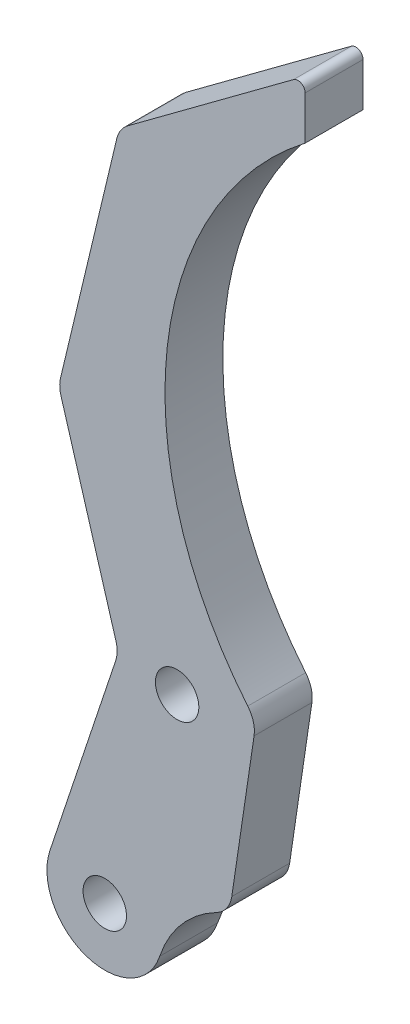
ISO-10303-21;
HEADER;
FILE_DESCRIPTION(('STEP AP214'),'2;1');
FILE_NAME('part.step','',(''),(''),'','','');
FILE_SCHEMA(('AUTOMOTIVE_DESIGN { 1 0 10303 214 1 1 1 1 }'));
ENDSEC;
DATA;
#1=APPLICATION_CONTEXT('core data for automotive mechanical design processes');
#2=APPLICATION_PROTOCOL_DEFINITION('international standard','automotive_design',2000,#1);
#3=PRODUCT_CONTEXT('',#1,'mechanical');
#4=PRODUCT('Part','Part','',(#3));
#5=PRODUCT_RELATED_PRODUCT_CATEGORY('part','',(#4));
#6=PRODUCT_DEFINITION_FORMATION('','',#4);
#7=PRODUCT_DEFINITION_CONTEXT('part definition',#1,'design');
#8=PRODUCT_DEFINITION('design','',#6,#7);
#9=PRODUCT_DEFINITION_SHAPE('','',#8);
#10=(LENGTH_UNIT() NAMED_UNIT(*) SI_UNIT(.MILLI.,.METRE.));
#11=(NAMED_UNIT(*) PLANE_ANGLE_UNIT() SI_UNIT($,.RADIAN.));
#12=(NAMED_UNIT(*) SI_UNIT($,.STERADIAN.) SOLID_ANGLE_UNIT());
#13=UNCERTAINTY_MEASURE_WITH_UNIT(LENGTH_MEASURE(1.E-05),#10,'distance_accuracy_value','');
#14=(GEOMETRIC_REPRESENTATION_CONTEXT(3) GLOBAL_UNCERTAINTY_ASSIGNED_CONTEXT((#13)) GLOBAL_UNIT_ASSIGNED_CONTEXT((#10,
#11,#12)) REPRESENTATION_CONTEXT('',''));
#15=CARTESIAN_POINT('',(0.,0.,0.));
#16=DIRECTION('',(0.,0.,1.));
#17=DIRECTION('',(1.,0.,0.));
#18=AXIS2_PLACEMENT_3D('',#15,#16,#17);
#19=CARTESIAN_POINT('',(9.9580579753652,55.9149215044284,4.));
#20=DIRECTION('',(0.,0.,-1.));
#21=DIRECTION('',(-1.,0.,0.));
#22=AXIS2_PLACEMENT_3D('',#19,#20,#21);
#23=PLANE('',#22);
#24=CARTESIAN_POINT('',(9.9580579753652,55.9149215044284,4.));
#25=DIRECTION('',(0.,0.,-1.));
#26=DIRECTION('',(-1.,0.,0.));
#27=AXIS2_PLACEMENT_3D('',#24,#25,#26);
#28=CIRCLE('',#27,25.);
#29=CARTESIAN_POINT('',(-9.31952103003914,39.997165767818,4.));
#30=VERTEX_POINT('',#29);
#31=CARTESIAN_POINT('',(-5.35274662100727,75.677999772039,4.));
#32=VERTEX_POINT('',#31);
#33=EDGE_CURVE('E207',#30,#32,#28,.T.);
#34=ORIENTED_EDGE('',*,*,#33,.T.);
#35=DIRECTION('',(0.,1.,0.));
#36=VECTOR('',#35,1.);
#37=CARTESIAN_POINT('',(-5.35274662100727,78.6846154430558,4.));
#38=LINE('',#37,#36);
#39=CARTESIAN_POINT('',(-5.35274662100727,78.6846154430558,4.));
#40=VERTEX_POINT('',#39);
#41=EDGE_CURVE('E120',#32,#40,#38,.T.);
#42=ORIENTED_EDGE('',*,*,#41,.T.);
#43=CARTESIAN_POINT('',(-5.85274662100727,78.6846154430558,4.));
#44=DIRECTION('',(0.,0.,1.));
#45=DIRECTION('',(-1.,0.,0.));
#46=AXIS2_PLACEMENT_3D('',#43,#44,#45);
#47=CIRCLE('',#46,0.499999999999991);
#48=CARTESIAN_POINT('',(-6.15061411090899,79.0862059788751,4.));
#49=VERTEX_POINT('',#48);
#50=EDGE_CURVE('E243',#40,#49,#47,.T.);
#51=ORIENTED_EDGE('',*,*,#50,.T.);
#52=DIRECTION('',(-0.803181071638629,-0.595734979803455,0.));
#53=VECTOR('',#52,1.);
#54=CARTESIAN_POINT('',(-17.6189757616203,70.5798996955029,4.));
#55=LINE('',#54,#53);
#56=CARTESIAN_POINT('',(-17.6189757616203,70.5798996955029,4.));
#57=VERTEX_POINT('',#56);
#58=EDGE_CURVE('E262',#49,#57,#55,.T.);
#59=ORIENTED_EDGE('',*,*,#58,.T.);
#60=CARTESIAN_POINT('',(-16.4275058020134,68.9735375522257,4.));
#61=DIRECTION('',(0.,0.,1.));
#62=DIRECTION('',(-1.,0.,0.));
#63=AXIS2_PLACEMENT_3D('',#60,#61,#62);
#64=CIRCLE('',#63,2.);
#65=CARTESIAN_POINT('',(-18.3727744260816,69.4382202183709,4.));
#66=VERTEX_POINT('',#65);
#67=EDGE_CURVE('E259',#57,#66,#64,.T.);
#68=ORIENTED_EDGE('',*,*,#67,.T.);
#69=DIRECTION('',(-0.232341333072594,-0.972634312034102,0.));
#70=VECTOR('',#69,1.);
#71=CARTESIAN_POINT('',(-22.2612764174017,53.1600556354505,4.));
#72=LINE('',#71,#70);
#73=CARTESIAN_POINT('',(-22.2612764174017,53.1600556354505,4.));
#74=VERTEX_POINT('',#73);
#75=EDGE_CURVE('E261',#66,#74,#72,.T.);
#76=ORIENTED_EDGE('',*,*,#75,.T.);
#77=CARTESIAN_POINT('',(-20.3160077933335,52.6953729693053,4.));
#78=DIRECTION('',(0.,0.,1.));
#79=DIRECTION('',(-1.,0.,0.));
#80=AXIS2_PLACEMENT_3D('',#77,#78,#79);
#81=CIRCLE('',#80,2.);
#82=CARTESIAN_POINT('',(-22.2330011720339,52.1251656508512,4.));
#83=VERTEX_POINT('',#82);
#84=EDGE_CURVE('E264',#74,#83,#81,.T.);
#85=ORIENTED_EDGE('',*,*,#84,.T.);
#86=DIRECTION('',(0.285103659227046,-0.958496689350228,0.));
#87=VECTOR('',#86,1.);
#88=CARTESIAN_POINT('',(-18.4315703806583,39.3450461735848,4.));
#89=LINE('',#88,#87);
#90=CARTESIAN_POINT('',(-18.4315703806583,39.3450461735848,4.));
#91=VERTEX_POINT('',#90);
#92=EDGE_CURVE('E270',#83,#91,#89,.T.);
#93=ORIENTED_EDGE('',*,*,#92,.T.);
#94=CARTESIAN_POINT('',(-20.3485637593588,38.7748388551307,4.));
#95=DIRECTION('',(0.,0.,-1.));
#96=DIRECTION('',(1.,0.,0.));
#97=AXIS2_PLACEMENT_3D('',#94,#95,#96);
#98=CIRCLE('',#97,2.);
#99=CARTESIAN_POINT('',(-18.4511972326077,38.1423831150474,4.));
#100=VERTEX_POINT('',#99);
#101=EDGE_CURVE('E272',#91,#100,#98,.T.);
#102=ORIENTED_EDGE('',*,*,#101,.T.);
#103=DIRECTION('',(-0.316227870041676,-0.948683263375562,0.));
#104=VECTOR('',#103,1.);
#105=CARTESIAN_POINT('',(-22.995202754365,24.5103715323581,4.));
#106=LINE('',#105,#104);
#107=CARTESIAN_POINT('',(-22.995202754365,24.5103715323581,4.));
#108=VERTEX_POINT('',#107);
#109=EDGE_CURVE('E274',#100,#108,#106,.T.);
#110=ORIENTED_EDGE('',*,*,#109,.T.);
#111=CARTESIAN_POINT('',(-19.2004680560857,23.2454595039322,4.));
#112=DIRECTION('',(0.,0.,1.));
#113=DIRECTION('',(1.,0.,0.));
#114=AXIS2_PLACEMENT_3D('',#111,#112,#113);
#115=CIRCLE('',#114,4.00000173374733);
#116=CARTESIAN_POINT('',(-15.4057333578063,21.9805474755062,4.));
#117=VERTEX_POINT('',#116);
#118=EDGE_CURVE('E276',#108,#117,#115,.T.);
#119=ORIENTED_EDGE('',*,*,#118,.T.);
#120=CARTESIAN_POINT('',(-7.81626725080184,19.4507245151728,4.));
#121=DIRECTION('',(0.,0.,-1.));
#122=DIRECTION('',(-1.,0.,0.));
#123=AXIS2_PLACEMENT_3D('',#120,#121,#122);
#124=CIRCLE('',#123,8.);
#125=CARTESIAN_POINT('',(-11.4848022519829,26.5600037293485,4.));
#126=VERTEX_POINT('',#125);
#127=EDGE_CURVE('E160',#117,#126,#124,.T.);
#128=ORIENTED_EDGE('',*,*,#127,.T.);
#129=CARTESIAN_POINT('',(-12.4019360022781,28.3373235328924,4.));
#130=DIRECTION('',(0.,0.,1.));
#131=DIRECTION('',(1.,0.,0.));
#132=AXIS2_PLACEMENT_3D('',#129,#130,#131);
#133=CIRCLE('',#132,2.);
#134=CARTESIAN_POINT('',(-10.4235699497073,28.0439504563578,4.));
#135=VERTEX_POINT('',#134);
#136=EDGE_CURVE('E154',#126,#135,#133,.T.);
#137=ORIENTED_EDGE('',*,*,#136,.T.);
#138=DIRECTION('',(0.146686538267296,0.989183026285407,0.));
#139=VECTOR('',#138,1.);
#140=CARTESIAN_POINT('',(-8.88336129790067,38.4303722323546,4.));
#141=LINE('',#140,#139);
#142=CARTESIAN_POINT('',(-8.88336129790067,38.4303722323546,4.));
#143=VERTEX_POINT('',#142);
#144=EDGE_CURVE('E158',#135,#143,#141,.T.);
#145=ORIENTED_EDGE('',*,*,#144,.T.);
#146=CARTESIAN_POINT('',(-10.8617273504715,38.7237453088892,4.));
#147=DIRECTION('',(0.,0.,1.));
#148=DIRECTION('',(1.,0.,0.));
#149=AXIS2_PLACEMENT_3D('',#146,#147,#148);
#150=CIRCLE('',#149,2.);
#151=EDGE_CURVE('E56',#143,#30,#150,.T.);
#152=ORIENTED_EDGE('',*,*,#151,.T.);
#153=EDGE_LOOP('',(#34,#42,#51,#59,#68,#76,#85,#93,#102,#110,#119,#128,#137,#145,#152));
#154=FACE_BOUND('',#153,.T.);
#155=CARTESIAN_POINT('',(-19.2004680560857,23.2454595039322,4.));
#156=DIRECTION('',(0.,0.,1.));
#157=DIRECTION('',(-1.,0.,0.));
#158=AXIS2_PLACEMENT_3D('',#155,#156,#157);
#159=CIRCLE('',#158,1.5);
#160=CARTESIAN_POINT('',(-20.7004680560857,23.2454595039322,4.));
#161=VERTEX_POINT('',#160);
#162=EDGE_CURVE('E182',#161,#161,#159,.T.);
#163=ORIENTED_EDGE('',*,*,#162,.F.);
#164=EDGE_LOOP('',(#163));
#165=FACE_BOUND('',#164,.T.);
#166=CARTESIAN_POINT('',(-14.2004680560857,38.2454595039322,4.));
#167=DIRECTION('',(0.,0.,1.));
#168=DIRECTION('',(1.,0.,0.));
#169=AXIS2_PLACEMENT_3D('',#166,#167,#168);
#170=CIRCLE('',#169,1.5);
#171=CARTESIAN_POINT('',(-12.7004680560857,38.2454595039322,4.));
#172=VERTEX_POINT('',#171);
#173=EDGE_CURVE('E317',#172,#172,#170,.T.);
#174=ORIENTED_EDGE('',*,*,#173,.F.);
#175=EDGE_LOOP('',(#174));
#176=FACE_BOUND('',#175,.T.);
#177=ADVANCED_FACE('F39',(#154,#165,#176),#23,.F.);
#178=CARTESIAN_POINT('',(9.9580579753652,55.9149215044284,0.));
#179=DIRECTION('',(0.,0.,-1.));
#180=DIRECTION('',(-1.,0.,0.));
#181=AXIS2_PLACEMENT_3D('',#178,#179,#180);
#182=PLANE('',#181);
#183=CARTESIAN_POINT('',(-19.2004680560857,23.2454595039322,0.));
#184=DIRECTION('',(0.,0.,1.));
#185=DIRECTION('',(-1.,0.,0.));
#186=AXIS2_PLACEMENT_3D('',#183,#184,#185);
#187=CIRCLE('',#186,1.5);
#188=CARTESIAN_POINT('',(-20.7004680560857,23.2454595039322,0.));
#189=VERTEX_POINT('',#188);
#190=EDGE_CURVE('E322',#189,#189,#187,.T.);
#191=ORIENTED_EDGE('',*,*,#190,.T.);
#192=EDGE_LOOP('',(#191));
#193=FACE_BOUND('',#192,.T.);
#194=CARTESIAN_POINT('',(9.9580579753652,55.9149215044284,0.));
#195=DIRECTION('',(0.,0.,-1.));
#196=DIRECTION('',(-1.,0.,0.));
#197=AXIS2_PLACEMENT_3D('',#194,#195,#196);
#198=CIRCLE('',#197,25.);
#199=CARTESIAN_POINT('',(-9.31952103003914,39.997165767818,0.));
#200=VERTEX_POINT('',#199);
#201=CARTESIAN_POINT('',(-5.35274662100727,75.677999772039,0.));
#202=VERTEX_POINT('',#201);
#203=EDGE_CURVE('E178',#200,#202,#198,.T.);
#204=ORIENTED_EDGE('',*,*,#203,.F.);
#205=CARTESIAN_POINT('',(-10.8617273504715,38.7237453088892,0.));
#206=DIRECTION('',(0.,0.,1.));
#207=DIRECTION('',(1.,0.,0.));
#208=AXIS2_PLACEMENT_3D('',#205,#206,#207);
#209=CIRCLE('',#208,2.);
#210=CARTESIAN_POINT('',(-8.88336129790067,38.4303722323546,0.));
#211=VERTEX_POINT('',#210);
#212=EDGE_CURVE('E112',#211,#200,#209,.T.);
#213=ORIENTED_EDGE('',*,*,#212,.F.);
#214=DIRECTION('',(0.146686538267296,0.989183026285407,0.));
#215=VECTOR('',#214,1.);
#216=CARTESIAN_POINT('',(-8.88336129790067,38.4303722323546,0.));
#217=LINE('',#216,#215);
#218=CARTESIAN_POINT('',(-10.4235699497073,28.0439504563578,0.));
#219=VERTEX_POINT('',#218);
#220=EDGE_CURVE('E106',#219,#211,#217,.T.);
#221=ORIENTED_EDGE('',*,*,#220,.F.);
#222=CARTESIAN_POINT('',(-12.4019360022781,28.3373235328924,0.));
#223=DIRECTION('',(0.,0.,1.));
#224=DIRECTION('',(1.,0.,0.));
#225=AXIS2_PLACEMENT_3D('',#222,#223,#224);
#226=CIRCLE('',#225,2.);
#227=CARTESIAN_POINT('',(-11.4848022519829,26.5600037293485,0.));
#228=VERTEX_POINT('',#227);
#229=EDGE_CURVE('E168',#228,#219,#226,.T.);
#230=ORIENTED_EDGE('',*,*,#229,.F.);
#231=CARTESIAN_POINT('',(-7.81626725080184,19.4507245151728,0.));
#232=DIRECTION('',(0.,0.,-1.));
#233=DIRECTION('',(-1.,0.,0.));
#234=AXIS2_PLACEMENT_3D('',#231,#232,#233);
#235=CIRCLE('',#234,8.);
#236=CARTESIAN_POINT('',(-15.4057333578063,21.9805474755062,0.));
#237=VERTEX_POINT('',#236);
#238=EDGE_CURVE('E202',#237,#228,#235,.T.);
#239=ORIENTED_EDGE('',*,*,#238,.F.);
#240=CARTESIAN_POINT('',(-19.2004680560857,23.2454595039322,0.));
#241=DIRECTION('',(0.,0.,1.));
#242=DIRECTION('',(1.,0.,0.));
#243=AXIS2_PLACEMENT_3D('',#240,#241,#242);
#244=CIRCLE('',#243,4.00000173374733);
#245=CARTESIAN_POINT('',(-22.995202754365,24.5103715323581,0.));
#246=VERTEX_POINT('',#245);
#247=EDGE_CURVE('E200',#246,#237,#244,.T.);
#248=ORIENTED_EDGE('',*,*,#247,.F.);
#249=DIRECTION('',(-0.316227870041676,-0.948683263375562,0.));
#250=VECTOR('',#249,1.);
#251=CARTESIAN_POINT('',(-22.995202754365,24.5103715323581,0.));
#252=LINE('',#251,#250);
#253=CARTESIAN_POINT('',(-18.4511972326077,38.1423831150474,0.));
#254=VERTEX_POINT('',#253);
#255=EDGE_CURVE('E198',#254,#246,#252,.T.);
#256=ORIENTED_EDGE('',*,*,#255,.F.);
#257=CARTESIAN_POINT('',(-20.3485637593588,38.7748388551307,0.));
#258=DIRECTION('',(0.,0.,-1.));
#259=DIRECTION('',(1.,0.,0.));
#260=AXIS2_PLACEMENT_3D('',#257,#258,#259);
#261=CIRCLE('',#260,2.);
#262=CARTESIAN_POINT('',(-18.4315703806583,39.3450461735848,0.));
#263=VERTEX_POINT('',#262);
#264=EDGE_CURVE('E196',#263,#254,#261,.T.);
#265=ORIENTED_EDGE('',*,*,#264,.F.);
#266=DIRECTION('',(0.285103659227046,-0.958496689350228,0.));
#267=VECTOR('',#266,1.);
#268=CARTESIAN_POINT('',(-18.4315703806583,39.3450461735848,0.));
#269=LINE('',#268,#267);
#270=CARTESIAN_POINT('',(-22.2330011720339,52.1251656508512,0.));
#271=VERTEX_POINT('',#270);
#272=EDGE_CURVE('E194',#271,#263,#269,.T.);
#273=ORIENTED_EDGE('',*,*,#272,.F.);
#274=CARTESIAN_POINT('',(-20.3160077933335,52.6953729693053,0.));
#275=DIRECTION('',(0.,0.,1.));
#276=DIRECTION('',(-1.,0.,0.));
#277=AXIS2_PLACEMENT_3D('',#274,#275,#276);
#278=CIRCLE('',#277,2.);
#279=CARTESIAN_POINT('',(-22.2612764174017,53.1600556354505,0.));
#280=VERTEX_POINT('',#279);
#281=EDGE_CURVE('E192',#280,#271,#278,.T.);
#282=ORIENTED_EDGE('',*,*,#281,.F.);
#283=DIRECTION('',(-0.232341333072594,-0.972634312034102,0.));
#284=VECTOR('',#283,1.);
#285=CARTESIAN_POINT('',(-22.2612764174017,53.1600556354505,0.));
#286=LINE('',#285,#284);
#287=CARTESIAN_POINT('',(-18.3727744260816,69.4382202183709,0.));
#288=VERTEX_POINT('',#287);
#289=EDGE_CURVE('E190',#288,#280,#286,.T.);
#290=ORIENTED_EDGE('',*,*,#289,.F.);
#291=CARTESIAN_POINT('',(-16.4275058020134,68.9735375522257,0.));
#292=DIRECTION('',(0.,0.,1.));
#293=DIRECTION('',(-1.,0.,0.));
#294=AXIS2_PLACEMENT_3D('',#291,#292,#293);
#295=CIRCLE('',#294,2.);
#296=CARTESIAN_POINT('',(-17.6189757616203,70.5798996955029,0.));
#297=VERTEX_POINT('',#296);
#298=EDGE_CURVE('E188',#297,#288,#295,.T.);
#299=ORIENTED_EDGE('',*,*,#298,.F.);
#300=DIRECTION('',(-0.803181071638629,-0.595734979803455,0.));
#301=VECTOR('',#300,1.);
#302=CARTESIAN_POINT('',(-17.6189757616203,70.5798996955029,0.));
#303=LINE('',#302,#301);
#304=CARTESIAN_POINT('',(-6.15061411090899,79.0862059788751,0.));
#305=VERTEX_POINT('',#304);
#306=EDGE_CURVE('E186',#305,#297,#303,.T.);
#307=ORIENTED_EDGE('',*,*,#306,.F.);
#308=CARTESIAN_POINT('',(-5.85274662100727,78.6846154430558,0.));
#309=DIRECTION('',(0.,0.,1.));
#310=DIRECTION('',(-1.,0.,0.));
#311=AXIS2_PLACEMENT_3D('',#308,#309,#310);
#312=CIRCLE('',#311,0.499999999999991);
#313=CARTESIAN_POINT('',(-5.35274662100727,78.6846154430558,0.));
#314=VERTEX_POINT('',#313);
#315=EDGE_CURVE('E184',#314,#305,#312,.T.);
#316=ORIENTED_EDGE('',*,*,#315,.F.);
#317=DIRECTION('',(0.,1.,0.));
#318=VECTOR('',#317,1.);
#319=CARTESIAN_POINT('',(-5.35274662100727,78.6846154430558,0.));
#320=LINE('',#319,#318);
#321=EDGE_CURVE('E181',#202,#314,#320,.T.);
#322=ORIENTED_EDGE('',*,*,#321,.F.);
#323=EDGE_LOOP('',(#204,#213,#221,#230,#239,#248,#256,#265,#273,#282,#290,#299,#307,#316,#322));
#324=FACE_BOUND('',#323,.T.);
#325=CARTESIAN_POINT('',(-14.2004680560857,38.2454595039322,0.));
#326=DIRECTION('',(0.,0.,1.));
#327=DIRECTION('',(1.,0.,0.));
#328=AXIS2_PLACEMENT_3D('',#325,#326,#327);
#329=CIRCLE('',#328,1.5);
#330=CARTESIAN_POINT('',(-12.7004680560857,38.2454595039322,0.));
#331=VERTEX_POINT('',#330);
#332=EDGE_CURVE('E320',#331,#331,#329,.T.);
#333=ORIENTED_EDGE('',*,*,#332,.T.);
#334=EDGE_LOOP('',(#333));
#335=FACE_BOUND('',#334,.T.);
#336=ADVANCED_FACE('F247',(#193,#324,#335),#182,.T.);
#337=CARTESIAN_POINT('',(9.9580579753652,55.9149215044284,4.));
#338=DIRECTION('',(0.,0.,-1.));
#339=DIRECTION('',(-1.,0.,0.));
#340=AXIS2_PLACEMENT_3D('',#337,#338,#339);
#341=CYLINDRICAL_SURFACE('',#340,25.);
#342=ORIENTED_EDGE('',*,*,#203,.T.);
#343=DIRECTION('',(0.,0.,-1.));
#344=VECTOR('',#343,1.);
#345=CARTESIAN_POINT('',(-5.35274662100727,75.677999772039,4.));
#346=LINE('',#345,#344);
#347=EDGE_CURVE('E11',#32,#202,#346,.T.);
#348=ORIENTED_EDGE('',*,*,#347,.F.);
#349=ORIENTED_EDGE('',*,*,#33,.F.);
#350=DIRECTION('',(0.,0.,-1.));
#351=VECTOR('',#350,1.);
#352=CARTESIAN_POINT('',(-9.31952103003914,39.997165767818,4.));
#353=LINE('',#352,#351);
#354=EDGE_CURVE('E174',#30,#200,#353,.T.);
#355=ORIENTED_EDGE('',*,*,#354,.T.);
#356=EDGE_LOOP('',(#342,#348,#349,#355));
#357=FACE_BOUND('',#356,.T.);
#358=ADVANCED_FACE('F41',(#357),#341,.F.);
#359=CARTESIAN_POINT('',(-5.35274662100727,78.6846154430558,4.));
#360=DIRECTION('',(-1.,0.,0.));
#361=DIRECTION('',(0.,0.,1.));
#362=AXIS2_PLACEMENT_3D('',#359,#360,#361);
#363=PLANE('',#362);
#364=ORIENTED_EDGE('',*,*,#321,.T.);
#365=DIRECTION('',(0.,0.,-1.));
#366=VECTOR('',#365,1.);
#367=CARTESIAN_POINT('',(-5.35274662100727,78.6846154430558,4.));
#368=LINE('',#367,#366);
#369=EDGE_CURVE('E48',#40,#314,#368,.T.);
#370=ORIENTED_EDGE('',*,*,#369,.F.);
#371=ORIENTED_EDGE('',*,*,#41,.F.);
#372=ORIENTED_EDGE('',*,*,#347,.T.);
#373=EDGE_LOOP('',(#364,#370,#371,#372));
#374=FACE_BOUND('',#373,.T.);
#375=ADVANCED_FACE('F447',(#374),#363,.F.);
#376=CARTESIAN_POINT('',(-5.85274662100727,78.6846154430558,4.));
#377=DIRECTION('',(0.,0.,-1.));
#378=DIRECTION('',(-1.,0.,0.));
#379=AXIS2_PLACEMENT_3D('',#376,#377,#378);
#380=CYLINDRICAL_SURFACE('',#379,0.499999999999991);
#381=ORIENTED_EDGE('',*,*,#315,.T.);
#382=DIRECTION('',(0.,0.,-1.));
#383=VECTOR('',#382,1.);
#384=CARTESIAN_POINT('',(-6.15061411090899,79.0862059788751,4.));
#385=LINE('',#384,#383);
#386=EDGE_CURVE('E235',#49,#305,#385,.T.);
#387=ORIENTED_EDGE('',*,*,#386,.F.);
#388=ORIENTED_EDGE('',*,*,#50,.F.);
#389=ORIENTED_EDGE('',*,*,#369,.T.);
#390=EDGE_LOOP('',(#381,#387,#388,#389));
#391=FACE_BOUND('',#390,.T.);
#392=ADVANCED_FACE('F241',(#391),#380,.T.);
#393=CARTESIAN_POINT('',(-17.6189757616203,70.5798996955029,4.));
#394=DIRECTION('',(0.595734979803455,-0.803181071638629,0.));
#395=DIRECTION('',(0.803181071638629,0.595734979803455,0.));
#396=AXIS2_PLACEMENT_3D('',#393,#394,#395);
#397=PLANE('',#396);
#398=ORIENTED_EDGE('',*,*,#306,.T.);
#399=DIRECTION('',(0.,0.,-1.));
#400=VECTOR('',#399,1.);
#401=CARTESIAN_POINT('',(-17.6189757616203,70.5798996955029,4.));
#402=LINE('',#401,#400);
#403=EDGE_CURVE('E232',#57,#297,#402,.T.);
#404=ORIENTED_EDGE('',*,*,#403,.F.);
#405=ORIENTED_EDGE('',*,*,#58,.F.);
#406=ORIENTED_EDGE('',*,*,#386,.T.);
#407=EDGE_LOOP('',(#398,#404,#405,#406));
#408=FACE_BOUND('',#407,.T.);
#409=ADVANCED_FACE('F253',(#408),#397,.F.);
#410=CARTESIAN_POINT('',(-16.4275058020134,68.9735375522257,4.));
#411=DIRECTION('',(0.,0.,-1.));
#412=DIRECTION('',(-1.,0.,0.));
#413=AXIS2_PLACEMENT_3D('',#410,#411,#412);
#414=CYLINDRICAL_SURFACE('',#413,2.);
#415=ORIENTED_EDGE('',*,*,#298,.T.);
#416=DIRECTION('',(0.,0.,-1.));
#417=VECTOR('',#416,1.);
#418=CARTESIAN_POINT('',(-18.3727744260816,69.4382202183709,4.));
#419=LINE('',#418,#417);
#420=EDGE_CURVE('E229',#66,#288,#419,.T.);
#421=ORIENTED_EDGE('',*,*,#420,.F.);
#422=ORIENTED_EDGE('',*,*,#67,.F.);
#423=ORIENTED_EDGE('',*,*,#403,.T.);
#424=EDGE_LOOP('',(#415,#421,#422,#423));
#425=FACE_BOUND('',#424,.T.);
#426=ADVANCED_FACE('F257',(#425),#414,.T.);
#427=CARTESIAN_POINT('',(-22.2612764174017,53.1600556354505,4.));
#428=DIRECTION('',(0.972634312034102,-0.232341333072594,0.));
#429=DIRECTION('',(0.232341333072594,0.972634312034102,0.));
#430=AXIS2_PLACEMENT_3D('',#427,#428,#429);
#431=PLANE('',#430);
#432=ORIENTED_EDGE('',*,*,#289,.T.);
#433=DIRECTION('',(0.,0.,-1.));
#434=VECTOR('',#433,1.);
#435=CARTESIAN_POINT('',(-22.2612764174017,53.1600556354505,4.));
#436=LINE('',#435,#434);
#437=EDGE_CURVE('E226',#74,#280,#436,.T.);
#438=ORIENTED_EDGE('',*,*,#437,.F.);
#439=ORIENTED_EDGE('',*,*,#75,.F.);
#440=ORIENTED_EDGE('',*,*,#420,.T.);
#441=EDGE_LOOP('',(#432,#438,#439,#440));
#442=FACE_BOUND('',#441,.T.);
#443=ADVANCED_FACE('F412',(#442),#431,.F.);
#444=CARTESIAN_POINT('',(-20.3160077933335,52.6953729693053,4.));
#445=DIRECTION('',(0.,0.,-1.));
#446=DIRECTION('',(-1.,0.,0.));
#447=AXIS2_PLACEMENT_3D('',#444,#445,#446);
#448=CYLINDRICAL_SURFACE('',#447,2.);
#449=ORIENTED_EDGE('',*,*,#281,.T.);
#450=DIRECTION('',(0.,0.,-1.));
#451=VECTOR('',#450,1.);
#452=CARTESIAN_POINT('',(-22.2330011720339,52.1251656508512,4.));
#453=LINE('',#452,#451);
#454=EDGE_CURVE('E223',#83,#271,#453,.T.);
#455=ORIENTED_EDGE('',*,*,#454,.F.);
#456=ORIENTED_EDGE('',*,*,#84,.F.);
#457=ORIENTED_EDGE('',*,*,#437,.T.);
#458=EDGE_LOOP('',(#449,#455,#456,#457));
#459=FACE_BOUND('',#458,.T.);
#460=ADVANCED_FACE('F402',(#459),#448,.T.);
#461=CARTESIAN_POINT('',(-18.4315703806583,39.3450461735848,4.));
#462=DIRECTION('',(0.958496689350228,0.285103659227046,0.));
#463=DIRECTION('',(-0.285103659227046,0.958496689350228,0.));
#464=AXIS2_PLACEMENT_3D('',#461,#462,#463);
#465=PLANE('',#464);
#466=ORIENTED_EDGE('',*,*,#272,.T.);
#467=DIRECTION('',(0.,0.,-1.));
#468=VECTOR('',#467,1.);
#469=CARTESIAN_POINT('',(-18.4315703806583,39.3450461735848,4.));
#470=LINE('',#469,#468);
#471=EDGE_CURVE('E220',#91,#263,#470,.T.);
#472=ORIENTED_EDGE('',*,*,#471,.F.);
#473=ORIENTED_EDGE('',*,*,#92,.F.);
#474=ORIENTED_EDGE('',*,*,#454,.T.);
#475=EDGE_LOOP('',(#466,#472,#473,#474));
#476=FACE_BOUND('',#475,.T.);
#477=ADVANCED_FACE('F392',(#476),#465,.F.);
#478=CARTESIAN_POINT('',(-20.3485637593588,38.7748388551307,4.));
#479=DIRECTION('',(0.,0.,-1.));
#480=DIRECTION('',(-1.,0.,0.));
#481=AXIS2_PLACEMENT_3D('',#478,#479,#480);
#482=CYLINDRICAL_SURFACE('',#481,2.);
#483=ORIENTED_EDGE('',*,*,#264,.T.);
#484=DIRECTION('',(0.,0.,-1.));
#485=VECTOR('',#484,1.);
#486=CARTESIAN_POINT('',(-18.4511972326077,38.1423831150474,4.));
#487=LINE('',#486,#485);
#488=EDGE_CURVE('E217',#100,#254,#487,.T.);
#489=ORIENTED_EDGE('',*,*,#488,.F.);
#490=ORIENTED_EDGE('',*,*,#101,.F.);
#491=ORIENTED_EDGE('',*,*,#471,.T.);
#492=EDGE_LOOP('',(#483,#489,#490,#491));
#493=FACE_BOUND('',#492,.T.);
#494=ADVANCED_FACE('F382',(#493),#482,.F.);
#495=CARTESIAN_POINT('',(-22.995202754365,24.5103715323581,4.));
#496=DIRECTION('',(0.948683263375562,-0.316227870041676,0.));
#497=DIRECTION('',(0.316227870041676,0.948683263375562,0.));
#498=AXIS2_PLACEMENT_3D('',#495,#496,#497);
#499=PLANE('',#498);
#500=ORIENTED_EDGE('',*,*,#255,.T.);
#501=DIRECTION('',(0.,0.,-1.));
#502=VECTOR('',#501,1.);
#503=CARTESIAN_POINT('',(-22.995202754365,24.5103715323581,4.));
#504=LINE('',#503,#502);
#505=EDGE_CURVE('E214',#108,#246,#504,.T.);
#506=ORIENTED_EDGE('',*,*,#505,.F.);
#507=ORIENTED_EDGE('',*,*,#109,.F.);
#508=ORIENTED_EDGE('',*,*,#488,.T.);
#509=EDGE_LOOP('',(#500,#506,#507,#508));
#510=FACE_BOUND('',#509,.T.);
#511=ADVANCED_FACE('F373',(#510),#499,.F.);
#512=CARTESIAN_POINT('',(-19.2004680560857,23.2454595039322,4.));
#513=DIRECTION('',(0.,0.,-1.));
#514=DIRECTION('',(-1.,0.,0.));
#515=AXIS2_PLACEMENT_3D('',#512,#513,#514);
#516=CYLINDRICAL_SURFACE('',#515,4.00000173374733);
#517=ORIENTED_EDGE('',*,*,#247,.T.);
#518=DIRECTION('',(0.,0.,-1.));
#519=VECTOR('',#518,1.);
#520=CARTESIAN_POINT('',(-15.4057333578063,21.9805474755062,4.));
#521=LINE('',#520,#519);
#522=EDGE_CURVE('E211',#117,#237,#521,.T.);
#523=ORIENTED_EDGE('',*,*,#522,.F.);
#524=ORIENTED_EDGE('',*,*,#118,.F.);
#525=ORIENTED_EDGE('',*,*,#505,.T.);
#526=EDGE_LOOP('',(#517,#523,#524,#525));
#527=FACE_BOUND('',#526,.T.);
#528=ADVANCED_FACE('F282',(#527),#516,.T.);
#529=CARTESIAN_POINT('',(-7.81626725080184,19.4507245151728,4.));
#530=DIRECTION('',(0.,0.,-1.));
#531=DIRECTION('',(-1.,0.,0.));
#532=AXIS2_PLACEMENT_3D('',#529,#530,#531);
#533=CYLINDRICAL_SURFACE('',#532,8.);
#534=ORIENTED_EDGE('',*,*,#238,.T.);
#535=DIRECTION('',(0.,0.,-1.));
#536=VECTOR('',#535,1.);
#537=CARTESIAN_POINT('',(-11.4848022519829,26.5600037293485,4.));
#538=LINE('',#537,#536);
#539=EDGE_CURVE('E169',#126,#228,#538,.T.);
#540=ORIENTED_EDGE('',*,*,#539,.F.);
#541=ORIENTED_EDGE('',*,*,#127,.F.);
#542=ORIENTED_EDGE('',*,*,#522,.T.);
#543=EDGE_LOOP('',(#534,#540,#541,#542));
#544=FACE_BOUND('',#543,.T.);
#545=ADVANCED_FACE('F286',(#544),#533,.F.);
#546=CARTESIAN_POINT('',(-12.4019360022781,28.3373235328924,4.));
#547=DIRECTION('',(0.,0.,-1.));
#548=DIRECTION('',(-1.,0.,0.));
#549=AXIS2_PLACEMENT_3D('',#546,#547,#548);
#550=CYLINDRICAL_SURFACE('',#549,2.);
#551=ORIENTED_EDGE('',*,*,#229,.T.);
#552=DIRECTION('',(0.,0.,-1.));
#553=VECTOR('',#552,1.);
#554=CARTESIAN_POINT('',(-10.4235699497073,28.0439504563578,4.));
#555=LINE('',#554,#553);
#556=EDGE_CURVE('E165',#135,#219,#555,.T.);
#557=ORIENTED_EDGE('',*,*,#556,.F.);
#558=ORIENTED_EDGE('',*,*,#136,.F.);
#559=ORIENTED_EDGE('',*,*,#539,.T.);
#560=EDGE_LOOP('',(#551,#557,#558,#559));
#561=FACE_BOUND('',#560,.T.);
#562=ADVANCED_FACE('F166',(#561),#550,.T.);
#563=CARTESIAN_POINT('',(-8.88336129790067,38.4303722323546,4.));
#564=DIRECTION('',(-0.989183026285407,0.146686538267296,0.));
#565=DIRECTION('',(-0.146686538267296,-0.989183026285407,0.));
#566=AXIS2_PLACEMENT_3D('',#563,#564,#565);
#567=PLANE('',#566);
#568=ORIENTED_EDGE('',*,*,#220,.T.);
#569=DIRECTION('',(0.,0.,-1.));
#570=VECTOR('',#569,1.);
#571=CARTESIAN_POINT('',(-8.88336129790067,38.4303722323546,4.));
#572=LINE('',#571,#570);
#573=EDGE_CURVE('E170',#143,#211,#572,.T.);
#574=ORIENTED_EDGE('',*,*,#573,.F.);
#575=ORIENTED_EDGE('',*,*,#144,.F.);
#576=ORIENTED_EDGE('',*,*,#556,.T.);
#577=EDGE_LOOP('',(#568,#574,#575,#576));
#578=FACE_BOUND('',#577,.T.);
#579=ADVANCED_FACE('F172',(#578),#567,.F.);
#580=CARTESIAN_POINT('',(-10.8617273504715,38.7237453088892,4.));
#581=DIRECTION('',(0.,0.,-1.));
#582=DIRECTION('',(-1.,0.,0.));
#583=AXIS2_PLACEMENT_3D('',#580,#581,#582);
#584=CYLINDRICAL_SURFACE('',#583,2.);
#585=ORIENTED_EDGE('',*,*,#212,.T.);
#586=ORIENTED_EDGE('',*,*,#354,.F.);
#587=ORIENTED_EDGE('',*,*,#151,.F.);
#588=ORIENTED_EDGE('',*,*,#573,.T.);
#589=EDGE_LOOP('',(#585,#586,#587,#588));
#590=FACE_BOUND('',#589,.T.);
#591=ADVANCED_FACE('F290',(#590),#584,.T.);
#592=CARTESIAN_POINT('',(-19.2004680560857,23.2454595039322,4.));
#593=DIRECTION('',(0.,0.,-1.));
#594=DIRECTION('',(-1.,0.,0.));
#595=AXIS2_PLACEMENT_3D('',#592,#593,#594);
#596=CYLINDRICAL_SURFACE('',#595,1.5);
#597=ORIENTED_EDGE('',*,*,#162,.T.);
#598=EDGE_LOOP('',(#597));
#599=FACE_BOUND('',#598,.T.);
#600=ORIENTED_EDGE('',*,*,#190,.F.);
#601=EDGE_LOOP('',(#600));
#602=FACE_BOUND('',#601,.T.);
#603=ADVANCED_FACE('F292',(#599,#602),#596,.F.);
#604=CARTESIAN_POINT('',(-14.2004680560857,38.2454595039322,4.));
#605=DIRECTION('',(0.,0.,-1.));
#606=DIRECTION('',(-1.,0.,0.));
#607=AXIS2_PLACEMENT_3D('',#604,#605,#606);
#608=CYLINDRICAL_SURFACE('',#607,1.5);
#609=ORIENTED_EDGE('',*,*,#173,.T.);
#610=EDGE_LOOP('',(#609));
#611=FACE_BOUND('',#610,.T.);
#612=ORIENTED_EDGE('',*,*,#332,.F.);
#613=EDGE_LOOP('',(#612));
#614=FACE_BOUND('',#613,.T.);
#615=ADVANCED_FACE('F298',(#611,#614),#608,.F.);
#616=CLOSED_SHELL('',(#177,#336,#358,#375,#392,#409,#426,#443,#460,#477,#494,#511,#528,#545,
#562,#579,#591,#603,#615));
#617=MANIFOLD_SOLID_BREP('B2',#616);
#618=ADVANCED_BREP_SHAPE_REPRESENTATION('',(#18,#617),#14);
#619=SHAPE_DEFINITION_REPRESENTATION(#9,#618);
ENDSEC;
END-ISO-10303-21;
